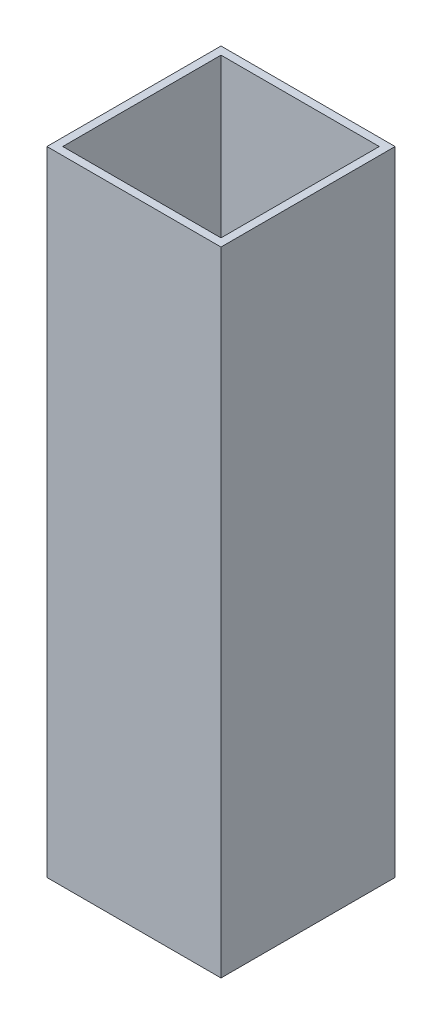
ISO-10303-21;
HEADER;
FILE_DESCRIPTION(('STEP AP214'),'2;1');
FILE_NAME('part.step','',(''),(''),'','','');
FILE_SCHEMA(('AUTOMOTIVE_DESIGN { 1 0 10303 214 1 1 1 1 }'));
ENDSEC;
DATA;
#1=APPLICATION_CONTEXT('core data for automotive mechanical design processes');
#2=APPLICATION_PROTOCOL_DEFINITION('international standard','automotive_design',2000,#1);
#3=PRODUCT_CONTEXT('',#1,'mechanical');
#4=PRODUCT('Part','Part','',(#3));
#5=PRODUCT_RELATED_PRODUCT_CATEGORY('part','',(#4));
#6=PRODUCT_DEFINITION_FORMATION('','',#4);
#7=PRODUCT_DEFINITION_CONTEXT('part definition',#1,'design');
#8=PRODUCT_DEFINITION('design','',#6,#7);
#9=PRODUCT_DEFINITION_SHAPE('','',#8);
#10=(LENGTH_UNIT() NAMED_UNIT(*) SI_UNIT(.MILLI.,.METRE.));
#11=(NAMED_UNIT(*) PLANE_ANGLE_UNIT() SI_UNIT($,.RADIAN.));
#12=(NAMED_UNIT(*) SI_UNIT($,.STERADIAN.) SOLID_ANGLE_UNIT());
#13=UNCERTAINTY_MEASURE_WITH_UNIT(LENGTH_MEASURE(1.E-05),#10,'distance_accuracy_value','');
#14=(GEOMETRIC_REPRESENTATION_CONTEXT(3) GLOBAL_UNCERTAINTY_ASSIGNED_CONTEXT((#13)) GLOBAL_UNIT_ASSIGNED_CONTEXT((#10,
#11,#12)) REPRESENTATION_CONTEXT('',''));
#15=CARTESIAN_POINT('',(0.,0.,0.));
#16=DIRECTION('',(0.,0.,1.));
#17=DIRECTION('',(1.,0.,0.));
#18=AXIS2_PLACEMENT_3D('',#15,#16,#17);
#19=CARTESIAN_POINT('',(-10.640487804878,40.,-10.5143902439024));
#20=DIRECTION('',(1.,0.,0.));
#21=DIRECTION('',(0.,0.,-1.));
#22=AXIS2_PLACEMENT_3D('',#19,#20,#21);
#23=PLANE('',#22);
#24=DIRECTION('',(0.,0.,1.));
#25=VECTOR('',#24,1.);
#26=CARTESIAN_POINT('',(-10.640487804878,0.,-10.5143902439024));
#27=LINE('',#26,#25);
#28=CARTESIAN_POINT('',(-10.640487804878,0.,-10.5143902439024));
#29=VERTEX_POINT('',#28);
#30=CARTESIAN_POINT('',(-10.640487804878,0.,0.485609756097561));
#31=VERTEX_POINT('',#30);
#32=EDGE_CURVE('E171',#29,#31,#27,.T.);
#33=ORIENTED_EDGE('',*,*,#32,.T.);
#34=DIRECTION('',(0.,-1.,0.));
#35=VECTOR('',#34,1.);
#36=CARTESIAN_POINT('',(-10.640487804878,40.,0.485609756097561));
#37=LINE('',#36,#35);
#38=CARTESIAN_POINT('',(-10.640487804878,40.,0.485609756097561));
#39=VERTEX_POINT('',#38);
#40=EDGE_CURVE('E11',#39,#31,#37,.T.);
#41=ORIENTED_EDGE('',*,*,#40,.F.);
#42=DIRECTION('',(0.,0.,1.));
#43=VECTOR('',#42,1.);
#44=CARTESIAN_POINT('',(-10.640487804878,40.,-10.5143902439024));
#45=LINE('',#44,#43);
#46=CARTESIAN_POINT('',(-10.640487804878,40.,-10.5143902439024));
#47=VERTEX_POINT('',#46);
#48=EDGE_CURVE('E160',#47,#39,#45,.T.);
#49=ORIENTED_EDGE('',*,*,#48,.F.);
#50=DIRECTION('',(0.,-1.,0.));
#51=VECTOR('',#50,1.);
#52=CARTESIAN_POINT('',(-10.640487804878,40.,-10.5143902439024));
#53=LINE('',#52,#51);
#54=EDGE_CURVE('E170',#47,#29,#53,.T.);
#55=ORIENTED_EDGE('',*,*,#54,.T.);
#56=EDGE_LOOP('',(#33,#41,#49,#55));
#57=FACE_BOUND('',#56,.T.);
#58=ADVANCED_FACE('F43',(#57),#23,.F.);
#59=CARTESIAN_POINT('',(-10.640487804878,40.,0.485609756097561));
#60=DIRECTION('',(0.,0.,-1.));
#61=DIRECTION('',(-1.,0.,0.));
#62=AXIS2_PLACEMENT_3D('',#59,#60,#61);
#63=PLANE('',#62);
#64=DIRECTION('',(1.,0.,0.));
#65=VECTOR('',#64,1.);
#66=CARTESIAN_POINT('',(-10.640487804878,0.,0.485609756097561));
#67=LINE('',#66,#65);
#68=CARTESIAN_POINT('',(0.359512195121952,0.,0.485609756097561));
#69=VERTEX_POINT('',#68);
#70=EDGE_CURVE('E175',#31,#69,#67,.T.);
#71=ORIENTED_EDGE('',*,*,#70,.T.);
#72=DIRECTION('',(0.,-1.,0.));
#73=VECTOR('',#72,1.);
#74=CARTESIAN_POINT('',(0.359512195121952,40.,0.485609756097561));
#75=LINE('',#74,#73);
#76=CARTESIAN_POINT('',(0.359512195121952,40.,0.485609756097561));
#77=VERTEX_POINT('',#76);
#78=EDGE_CURVE('E51',#77,#69,#75,.T.);
#79=ORIENTED_EDGE('',*,*,#78,.F.);
#80=DIRECTION('',(1.,0.,0.));
#81=VECTOR('',#80,1.);
#82=CARTESIAN_POINT('',(-10.640487804878,40.,0.485609756097561));
#83=LINE('',#82,#81);
#84=EDGE_CURVE('E95',#39,#77,#83,.T.);
#85=ORIENTED_EDGE('',*,*,#84,.F.);
#86=ORIENTED_EDGE('',*,*,#40,.T.);
#87=EDGE_LOOP('',(#71,#79,#85,#86));
#88=FACE_BOUND('',#87,.T.);
#89=ADVANCED_FACE('F210',(#88),#63,.F.);
#90=CARTESIAN_POINT('',(0.35951219512195,40.,-10.5143902439024));
#91=DIRECTION('',(-1.,0.,0.));
#92=DIRECTION('',(0.,0.,1.));
#93=AXIS2_PLACEMENT_3D('',#90,#91,#92);
#94=PLANE('',#93);
#95=DIRECTION('',(0.,0.,-1.));
#96=VECTOR('',#95,1.);
#97=CARTESIAN_POINT('',(0.35951219512195,0.,-10.5143902439024));
#98=LINE('',#97,#96);
#99=CARTESIAN_POINT('',(0.35951219512195,0.,-10.5143902439024));
#100=VERTEX_POINT('',#99);
#101=EDGE_CURVE('E178',#69,#100,#98,.T.);
#102=ORIENTED_EDGE('',*,*,#101,.T.);
#103=DIRECTION('',(0.,-1.,0.));
#104=VECTOR('',#103,1.);
#105=CARTESIAN_POINT('',(0.35951219512195,40.,-10.5143902439024));
#106=LINE('',#105,#104);
#107=CARTESIAN_POINT('',(0.35951219512195,40.,-10.5143902439024));
#108=VERTEX_POINT('',#107);
#109=EDGE_CURVE('E185',#108,#100,#106,.T.);
#110=ORIENTED_EDGE('',*,*,#109,.F.);
#111=DIRECTION('',(0.,0.,-1.));
#112=VECTOR('',#111,1.);
#113=CARTESIAN_POINT('',(0.35951219512195,40.,-10.5143902439024));
#114=LINE('',#113,#112);
#115=EDGE_CURVE('E165',#77,#108,#114,.T.);
#116=ORIENTED_EDGE('',*,*,#115,.F.);
#117=ORIENTED_EDGE('',*,*,#78,.T.);
#118=EDGE_LOOP('',(#102,#110,#116,#117));
#119=FACE_BOUND('',#118,.T.);
#120=ADVANCED_FACE('F192',(#119),#94,.F.);
#121=CARTESIAN_POINT('',(-10.640487804878,40.,-10.5143902439024));
#122=DIRECTION('',(0.,0.,1.));
#123=DIRECTION('',(1.,0.,0.));
#124=AXIS2_PLACEMENT_3D('',#121,#122,#123);
#125=PLANE('',#124);
#126=DIRECTION('',(-1.,0.,0.));
#127=VECTOR('',#126,1.);
#128=CARTESIAN_POINT('',(-10.640487804878,0.,-10.5143902439024));
#129=LINE('',#128,#127);
#130=EDGE_CURVE('E88',#100,#29,#129,.T.);
#131=ORIENTED_EDGE('',*,*,#130,.T.);
#132=ORIENTED_EDGE('',*,*,#54,.F.);
#133=DIRECTION('',(-1.,0.,0.));
#134=VECTOR('',#133,1.);
#135=CARTESIAN_POINT('',(-10.640487804878,40.,-10.5143902439024));
#136=LINE('',#135,#134);
#137=EDGE_CURVE('E67',#108,#47,#136,.T.);
#138=ORIENTED_EDGE('',*,*,#137,.F.);
#139=ORIENTED_EDGE('',*,*,#109,.T.);
#140=EDGE_LOOP('',(#131,#132,#138,#139));
#141=FACE_BOUND('',#140,.T.);
#142=ADVANCED_FACE('F200',(#141),#125,.F.);
#143=CARTESIAN_POINT('',(0.,40.,0.));
#144=DIRECTION('',(0.,1.,0.));
#145=DIRECTION('',(0.,0.,1.));
#146=AXIS2_PLACEMENT_3D('',#143,#144,#145);
#147=PLANE('',#146);
#148=DIRECTION('',(0.,0.,1.));
#149=VECTOR('',#148,1.);
#150=CARTESIAN_POINT('',(-10.140487804878,40.,-10.5143902439024));
#151=LINE('',#150,#149);
#152=CARTESIAN_POINT('',(-10.140487804878,40.,-10.0143902439024));
#153=VERTEX_POINT('',#152);
#154=CARTESIAN_POINT('',(-10.140487804878,40.,-0.0143902439024392));
#155=VERTEX_POINT('',#154);
#156=EDGE_CURVE('E144',#153,#155,#151,.T.);
#157=ORIENTED_EDGE('',*,*,#156,.F.);
#158=DIRECTION('',(-1.,0.,0.));
#159=VECTOR('',#158,1.);
#160=CARTESIAN_POINT('',(-10.640487804878,40.,-10.0143902439024));
#161=LINE('',#160,#159);
#162=CARTESIAN_POINT('',(-0.14048780487805,40.,-10.0143902439024));
#163=VERTEX_POINT('',#162);
#164=EDGE_CURVE('E157',#163,#153,#161,.T.);
#165=ORIENTED_EDGE('',*,*,#164,.F.);
#166=DIRECTION('',(0.,0.,-1.));
#167=VECTOR('',#166,1.);
#168=CARTESIAN_POINT('',(-0.14048780487805,40.,-10.5143902439024));
#169=LINE('',#168,#167);
#170=CARTESIAN_POINT('',(-0.140487804878048,40.,-0.0143902439024392));
#171=VERTEX_POINT('',#170);
#172=EDGE_CURVE('E154',#171,#163,#169,.T.);
#173=ORIENTED_EDGE('',*,*,#172,.F.);
#174=DIRECTION('',(1.,0.,0.));
#175=VECTOR('',#174,1.);
#176=CARTESIAN_POINT('',(-10.640487804878,40.,-0.0143902439024392));
#177=LINE('',#176,#175);
#178=EDGE_CURVE('E133',#155,#171,#177,.T.);
#179=ORIENTED_EDGE('',*,*,#178,.F.);
#180=EDGE_LOOP('',(#157,#165,#173,#179));
#181=FACE_BOUND('',#180,.T.);
#182=ORIENTED_EDGE('',*,*,#48,.T.);
#183=ORIENTED_EDGE('',*,*,#84,.T.);
#184=ORIENTED_EDGE('',*,*,#115,.T.);
#185=ORIENTED_EDGE('',*,*,#137,.T.);
#186=EDGE_LOOP('',(#182,#183,#184,#185));
#187=FACE_BOUND('',#186,.T.);
#188=ADVANCED_FACE('F202',(#181,#187),#147,.T.);
#189=CARTESIAN_POINT('',(0.,0.,0.));
#190=DIRECTION('',(0.,1.,0.));
#191=DIRECTION('',(0.,0.,1.));
#192=AXIS2_PLACEMENT_3D('',#189,#190,#191);
#193=PLANE('',#192);
#194=ORIENTED_EDGE('',*,*,#32,.F.);
#195=ORIENTED_EDGE('',*,*,#130,.F.);
#196=ORIENTED_EDGE('',*,*,#101,.F.);
#197=ORIENTED_EDGE('',*,*,#70,.F.);
#198=EDGE_LOOP('',(#194,#195,#196,#197));
#199=FACE_BOUND('',#198,.T.);
#200=ADVANCED_FACE('F196',(#199),#193,.F.);
#201=CARTESIAN_POINT('',(-10.140487804878,40.,-10.5143902439024));
#202=DIRECTION('',(1.,0.,0.));
#203=DIRECTION('',(0.,0.,-1.));
#204=AXIS2_PLACEMENT_3D('',#201,#202,#203);
#205=PLANE('',#204);
#206=DIRECTION('',(0.,0.,1.));
#207=VECTOR('',#206,1.);
#208=CARTESIAN_POINT('',(-10.140487804878,0.5,-10.5143902439024));
#209=LINE('',#208,#207);
#210=CARTESIAN_POINT('',(-10.140487804878,0.5,-10.0143902439024));
#211=VERTEX_POINT('',#210);
#212=CARTESIAN_POINT('',(-10.140487804878,0.5,-0.0143902439024392));
#213=VERTEX_POINT('',#212);
#214=EDGE_CURVE('E123',#211,#213,#209,.T.);
#215=ORIENTED_EDGE('',*,*,#214,.F.);
#216=DIRECTION('',(0.,-1.,0.));
#217=VECTOR('',#216,1.);
#218=CARTESIAN_POINT('',(-10.140487804878,40.,-10.0143902439024));
#219=LINE('',#218,#217);
#220=EDGE_CURVE('E148',#153,#211,#219,.T.);
#221=ORIENTED_EDGE('',*,*,#220,.F.);
#222=ORIENTED_EDGE('',*,*,#156,.T.);
#223=DIRECTION('',(0.,-1.,0.));
#224=VECTOR('',#223,1.);
#225=CARTESIAN_POINT('',(-10.140487804878,40.,-0.0143902439024392));
#226=LINE('',#225,#224);
#227=EDGE_CURVE('E137',#155,#213,#226,.T.);
#228=ORIENTED_EDGE('',*,*,#227,.T.);
#229=EDGE_LOOP('',(#215,#221,#222,#228));
#230=FACE_BOUND('',#229,.T.);
#231=ADVANCED_FACE('F239',(#230),#205,.T.);
#232=CARTESIAN_POINT('',(-10.640487804878,40.,-0.0143902439024392));
#233=DIRECTION('',(0.,0.,-1.));
#234=DIRECTION('',(-1.,0.,0.));
#235=AXIS2_PLACEMENT_3D('',#232,#233,#234);
#236=PLANE('',#235);
#237=DIRECTION('',(1.,0.,0.));
#238=VECTOR('',#237,1.);
#239=CARTESIAN_POINT('',(-10.640487804878,0.5,-0.0143902439024392));
#240=LINE('',#239,#238);
#241=CARTESIAN_POINT('',(-0.140487804878048,0.5,-0.0143902439024392));
#242=VERTEX_POINT('',#241);
#243=EDGE_CURVE('E117',#213,#242,#240,.T.);
#244=ORIENTED_EDGE('',*,*,#243,.F.);
#245=ORIENTED_EDGE('',*,*,#227,.F.);
#246=ORIENTED_EDGE('',*,*,#178,.T.);
#247=DIRECTION('',(0.,-1.,0.));
#248=VECTOR('',#247,1.);
#249=CARTESIAN_POINT('',(-0.140487804878048,40.,-0.0143902439024395));
#250=LINE('',#249,#248);
#251=EDGE_CURVE('E130',#171,#242,#250,.T.);
#252=ORIENTED_EDGE('',*,*,#251,.T.);
#253=EDGE_LOOP('',(#244,#245,#246,#252));
#254=FACE_BOUND('',#253,.T.);
#255=ADVANCED_FACE('F131',(#254),#236,.T.);
#256=CARTESIAN_POINT('',(-0.14048780487805,40.,-10.5143902439024));
#257=DIRECTION('',(-1.,0.,0.));
#258=DIRECTION('',(0.,0.,1.));
#259=AXIS2_PLACEMENT_3D('',#256,#257,#258);
#260=PLANE('',#259);
#261=DIRECTION('',(0.,0.,-1.));
#262=VECTOR('',#261,1.);
#263=CARTESIAN_POINT('',(-0.14048780487805,0.5,-10.5143902439024));
#264=LINE('',#263,#262);
#265=CARTESIAN_POINT('',(-0.14048780487805,0.5,-10.0143902439024));
#266=VERTEX_POINT('',#265);
#267=EDGE_CURVE('E121',#242,#266,#264,.T.);
#268=ORIENTED_EDGE('',*,*,#267,.F.);
#269=ORIENTED_EDGE('',*,*,#251,.F.);
#270=ORIENTED_EDGE('',*,*,#172,.T.);
#271=DIRECTION('',(0.,-1.,0.));
#272=VECTOR('',#271,1.);
#273=CARTESIAN_POINT('',(-0.14048780487805,40.,-10.0143902439024));
#274=LINE('',#273,#272);
#275=EDGE_CURVE('E58',#163,#266,#274,.T.);
#276=ORIENTED_EDGE('',*,*,#275,.T.);
#277=EDGE_LOOP('',(#268,#269,#270,#276));
#278=FACE_BOUND('',#277,.T.);
#279=ADVANCED_FACE('F139',(#278),#260,.T.);
#280=CARTESIAN_POINT('',(-10.640487804878,40.,-10.0143902439024));
#281=DIRECTION('',(0.,0.,1.));
#282=DIRECTION('',(1.,0.,0.));
#283=AXIS2_PLACEMENT_3D('',#280,#281,#282);
#284=PLANE('',#283);
#285=DIRECTION('',(-1.,0.,0.));
#286=VECTOR('',#285,1.);
#287=CARTESIAN_POINT('',(-10.640487804878,0.5,-10.0143902439024));
#288=LINE('',#287,#286);
#289=EDGE_CURVE('E141',#266,#211,#288,.T.);
#290=ORIENTED_EDGE('',*,*,#289,.F.);
#291=ORIENTED_EDGE('',*,*,#275,.F.);
#292=ORIENTED_EDGE('',*,*,#164,.T.);
#293=ORIENTED_EDGE('',*,*,#220,.T.);
#294=EDGE_LOOP('',(#290,#291,#292,#293));
#295=FACE_BOUND('',#294,.T.);
#296=ADVANCED_FACE('F273',(#295),#284,.T.);
#297=CARTESIAN_POINT('',(0.,0.5,0.));
#298=DIRECTION('',(0.,1.,0.));
#299=DIRECTION('',(0.,0.,1.));
#300=AXIS2_PLACEMENT_3D('',#297,#298,#299);
#301=PLANE('',#300);
#302=ORIENTED_EDGE('',*,*,#214,.T.);
#303=ORIENTED_EDGE('',*,*,#243,.T.);
#304=ORIENTED_EDGE('',*,*,#267,.T.);
#305=ORIENTED_EDGE('',*,*,#289,.T.);
#306=EDGE_LOOP('',(#302,#303,#304,#305));
#307=FACE_BOUND('',#306,.T.);
#308=ADVANCED_FACE('F119',(#307),#301,.T.);
#309=CLOSED_SHELL('',(#58,#89,#120,#142,#188,#200,#231,#255,#279,#296,#308));
#310=MANIFOLD_SOLID_BREP('B2',#309);
#311=ADVANCED_BREP_SHAPE_REPRESENTATION('',(#18,#310),#14);
#312=SHAPE_DEFINITION_REPRESENTATION(#9,#311);
ENDSEC;
END-ISO-10303-21;
